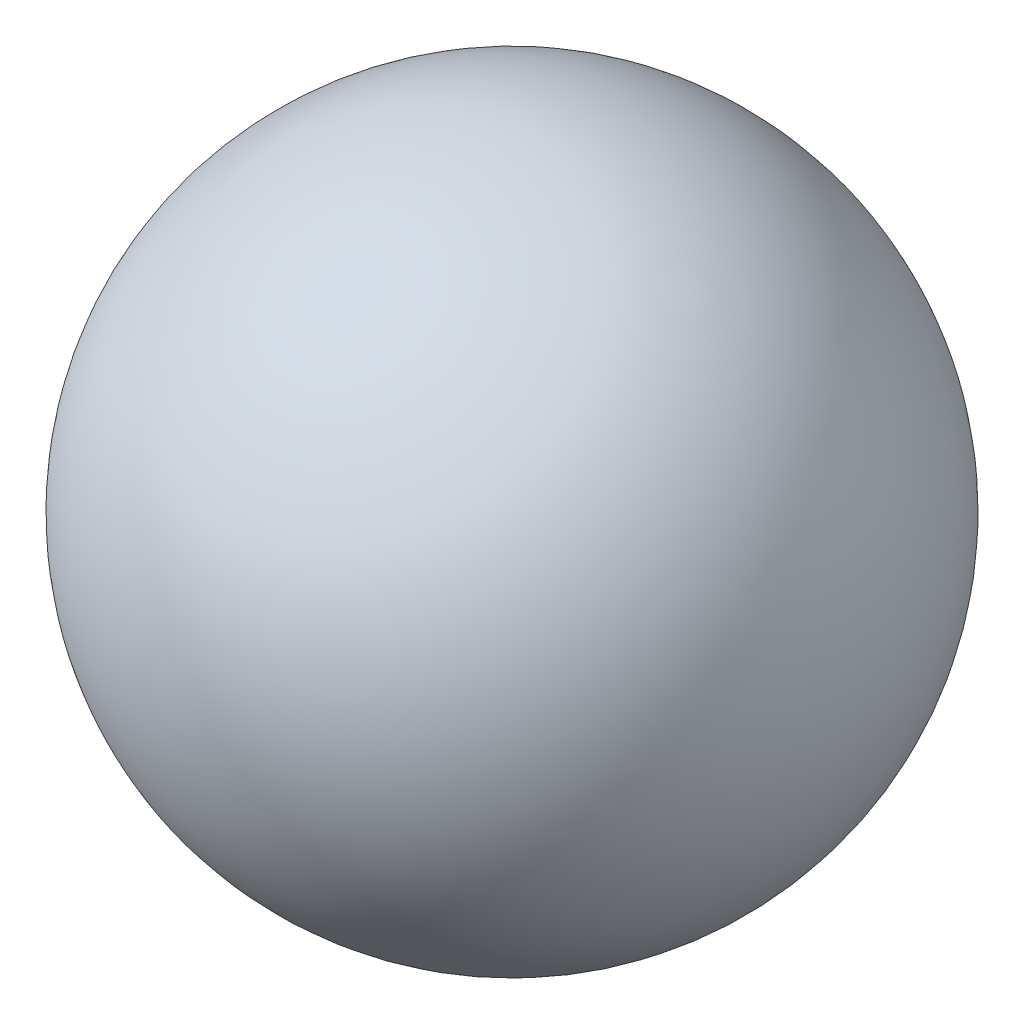
ISO-10303-21;
HEADER;
FILE_DESCRIPTION(('STEP AP214'),'2;1');
FILE_NAME('part.step','',(''),(''),'','','');
FILE_SCHEMA(('AUTOMOTIVE_DESIGN { 1 0 10303 214 1 1 1 1 }'));
ENDSEC;
DATA;
#1=APPLICATION_CONTEXT('core data for automotive mechanical design processes');
#2=APPLICATION_PROTOCOL_DEFINITION('international standard','automotive_design',2000,#1);
#3=PRODUCT_CONTEXT('',#1,'mechanical');
#4=PRODUCT('Part','Part','',(#3));
#5=PRODUCT_RELATED_PRODUCT_CATEGORY('part','',(#4));
#6=PRODUCT_DEFINITION_FORMATION('','',#4);
#7=PRODUCT_DEFINITION_CONTEXT('part definition',#1,'design');
#8=PRODUCT_DEFINITION('design','',#6,#7);
#9=PRODUCT_DEFINITION_SHAPE('','',#8);
#10=(LENGTH_UNIT() NAMED_UNIT(*) SI_UNIT(.MILLI.,.METRE.));
#11=(NAMED_UNIT(*) PLANE_ANGLE_UNIT() SI_UNIT($,.RADIAN.));
#12=(NAMED_UNIT(*) SI_UNIT($,.STERADIAN.) SOLID_ANGLE_UNIT());
#13=UNCERTAINTY_MEASURE_WITH_UNIT(LENGTH_MEASURE(1.E-05),#10,'distance_accuracy_value','');
#14=(GEOMETRIC_REPRESENTATION_CONTEXT(3) GLOBAL_UNCERTAINTY_ASSIGNED_CONTEXT((#13)) GLOBAL_UNIT_ASSIGNED_CONTEXT((#10,
#11,#12)) REPRESENTATION_CONTEXT('',''));
#15=CARTESIAN_POINT('',(0.,0.,0.));
#16=DIRECTION('',(0.,0.,1.));
#17=DIRECTION('',(1.,0.,0.));
#18=AXIS2_PLACEMENT_3D('',#15,#16,#17);
#19=CARTESIAN_POINT('',(0.,0.,0.));
#20=DIRECTION('',(0.,0.,1.));
#21=DIRECTION('',(1.,0.,0.));
#22=AXIS2_PLACEMENT_3D('',#19,#20,#21);
#23=SPHERICAL_SURFACE('',#22,0.14500098);
#24=CARTESIAN_POINT('',(0.,0.,-0.14500098));
#25=VERTEX_POINT('',#24);
#26=VERTEX_LOOP('',#25);
#27=FACE_BOUND('',#26,.T.);
#28=ADVANCED_FACE('F15',(#27),#23,.T.);
#29=CLOSED_SHELL('',(#28));
#30=MANIFOLD_SOLID_BREP('B1',#29);
#31=ADVANCED_BREP_SHAPE_REPRESENTATION('',(#18,#30),#14);
#32=SHAPE_DEFINITION_REPRESENTATION(#9,#31);
ENDSEC;
END-ISO-10303-21;
